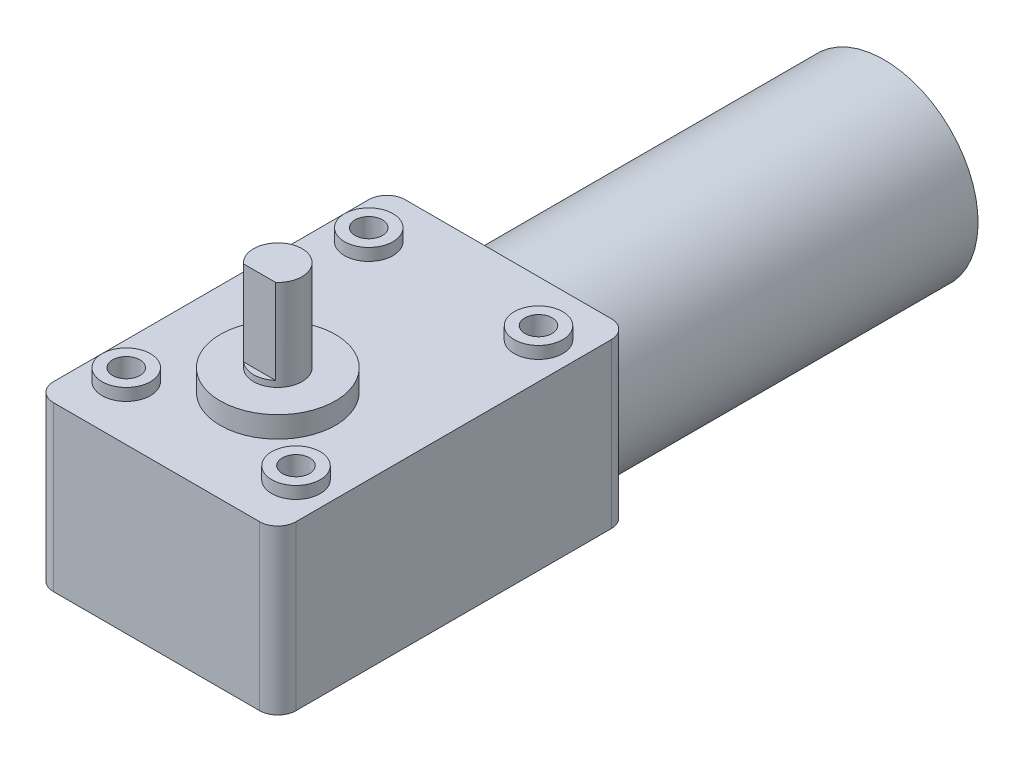
ISO-10303-21;
HEADER;
FILE_DESCRIPTION(('STEP AP214'),'2;1');
FILE_NAME('part.step','',(''),(''),'','','');
FILE_SCHEMA(('AUTOMOTIVE_DESIGN { 1 0 10303 214 1 1 1 1 }'));
ENDSEC;
DATA;
#1=APPLICATION_CONTEXT('core data for automotive mechanical design processes');
#2=APPLICATION_PROTOCOL_DEFINITION('international standard','automotive_design',2000,#1);
#3=PRODUCT_CONTEXT('',#1,'mechanical');
#4=PRODUCT('Part','Part','',(#3));
#5=PRODUCT_RELATED_PRODUCT_CATEGORY('part','',(#4));
#6=PRODUCT_DEFINITION_FORMATION('','',#4);
#7=PRODUCT_DEFINITION_CONTEXT('part definition',#1,'design');
#8=PRODUCT_DEFINITION('design','',#6,#7);
#9=PRODUCT_DEFINITION_SHAPE('','',#8);
#10=(LENGTH_UNIT() NAMED_UNIT(*) SI_UNIT(.MILLI.,.METRE.));
#11=(NAMED_UNIT(*) PLANE_ANGLE_UNIT() SI_UNIT($,.RADIAN.));
#12=(NAMED_UNIT(*) SI_UNIT($,.STERADIAN.) SOLID_ANGLE_UNIT());
#13=UNCERTAINTY_MEASURE_WITH_UNIT(LENGTH_MEASURE(1.E-05),#10,'distance_accuracy_value','');
#14=(GEOMETRIC_REPRESENTATION_CONTEXT(3) GLOBAL_UNCERTAINTY_ASSIGNED_CONTEXT((#13)) GLOBAL_UNIT_ASSIGNED_CONTEXT((#10,
#11,#12)) REPRESENTATION_CONTEXT('',''));
#15=CARTESIAN_POINT('',(0.,0.,0.));
#16=DIRECTION('',(0.,0.,1.));
#17=DIRECTION('',(1.,0.,0.));
#18=AXIS2_PLACEMENT_3D('',#15,#16,#17);
#19=CARTESIAN_POINT('',(-37.,27.,-55.));
#20=DIRECTION('',(0.,-1.,0.));
#21=DIRECTION('',(0.,0.,-1.));
#22=AXIS2_PLACEMENT_3D('',#19,#20,#21);
#23=CYLINDRICAL_SURFACE('',#22,3.);
#24=CARTESIAN_POINT('',(-37.,0.,-55.));
#25=DIRECTION('',(0.,1.,0.));
#26=DIRECTION('',(0.,0.,1.));
#27=AXIS2_PLACEMENT_3D('',#24,#25,#26);
#28=CIRCLE('',#27,3.);
#29=CARTESIAN_POINT('',(-40.,0.,-55.));
#30=VERTEX_POINT('',#29);
#31=CARTESIAN_POINT('',(-37.,0.,-58.));
#32=VERTEX_POINT('',#31);
#33=EDGE_CURVE('E195',#30,#32,#28,.F.);
#34=ORIENTED_EDGE('',*,*,#33,.F.);
#35=DIRECTION('',(0.,-1.,0.));
#36=VECTOR('',#35,1.);
#37=CARTESIAN_POINT('',(-40.,27.,-55.));
#38=LINE('',#37,#36);
#39=CARTESIAN_POINT('',(-40.,27.,-55.));
#40=VERTEX_POINT('',#39);
#41=EDGE_CURVE('E336',#40,#30,#38,.T.);
#42=ORIENTED_EDGE('',*,*,#41,.F.);
#43=CARTESIAN_POINT('',(-37.,27.,-55.));
#44=DIRECTION('',(0.,1.,0.));
#45=DIRECTION('',(0.,0.,1.));
#46=AXIS2_PLACEMENT_3D('',#43,#44,#45);
#47=CIRCLE('',#46,3.);
#48=CARTESIAN_POINT('',(-37.,27.,-58.));
#49=VERTEX_POINT('',#48);
#50=EDGE_CURVE('E289',#40,#49,#47,.F.);
#51=ORIENTED_EDGE('',*,*,#50,.T.);
#52=DIRECTION('',(0.,-1.,0.));
#53=VECTOR('',#52,1.);
#54=CARTESIAN_POINT('',(-37.,27.,-58.));
#55=LINE('',#54,#53);
#56=EDGE_CURVE('E98',#49,#32,#55,.T.);
#57=ORIENTED_EDGE('',*,*,#56,.T.);
#58=EDGE_LOOP('',(#34,#42,#51,#57));
#59=FACE_BOUND('',#58,.T.);
#60=ADVANCED_FACE('F94',(#59),#23,.T.);
#61=CARTESIAN_POINT('',(-40.,27.,0.));
#62=DIRECTION('',(-1.,0.,0.));
#63=DIRECTION('',(0.,0.,1.));
#64=AXIS2_PLACEMENT_3D('',#61,#62,#63);
#65=PLANE('',#64);
#66=DIRECTION('',(0.,0.,-1.));
#67=VECTOR('',#66,1.);
#68=CARTESIAN_POINT('',(-40.,0.,0.));
#69=LINE('',#68,#67);
#70=CARTESIAN_POINT('',(-40.,0.,-3.00000000000002));
#71=VERTEX_POINT('',#70);
#72=EDGE_CURVE('E311',#71,#30,#69,.T.);
#73=ORIENTED_EDGE('',*,*,#72,.F.);
#74=DIRECTION('',(0.,-1.,0.));
#75=VECTOR('',#74,1.);
#76=CARTESIAN_POINT('',(-40.,27.,-3.00000000000002));
#77=LINE('',#76,#75);
#78=CARTESIAN_POINT('',(-40.,27.,-3.00000000000002));
#79=VERTEX_POINT('',#78);
#80=EDGE_CURVE('E335',#79,#71,#77,.T.);
#81=ORIENTED_EDGE('',*,*,#80,.F.);
#82=DIRECTION('',(0.,0.,-1.));
#83=VECTOR('',#82,1.);
#84=CARTESIAN_POINT('',(-40.,27.,0.));
#85=LINE('',#84,#83);
#86=EDGE_CURVE('E293',#79,#40,#85,.T.);
#87=ORIENTED_EDGE('',*,*,#86,.T.);
#88=ORIENTED_EDGE('',*,*,#41,.T.);
#89=EDGE_LOOP('',(#73,#81,#87,#88));
#90=FACE_BOUND('',#89,.T.);
#91=ADVANCED_FACE('F366',(#90),#65,.T.);
#92=CARTESIAN_POINT('',(-37.,27.,-3.));
#93=DIRECTION('',(0.,-1.,0.));
#94=DIRECTION('',(0.,0.,-1.));
#95=AXIS2_PLACEMENT_3D('',#92,#93,#94);
#96=CYLINDRICAL_SURFACE('',#95,3.);
#97=CARTESIAN_POINT('',(-37.,0.,-3.));
#98=DIRECTION('',(0.,1.,0.));
#99=DIRECTION('',(0.,0.,1.));
#100=AXIS2_PLACEMENT_3D('',#97,#98,#99);
#101=CIRCLE('',#100,3.);
#102=CARTESIAN_POINT('',(-37.,0.,0.));
#103=VERTEX_POINT('',#102);
#104=EDGE_CURVE('E313',#103,#71,#101,.F.);
#105=ORIENTED_EDGE('',*,*,#104,.F.);
#106=DIRECTION('',(0.,-1.,0.));
#107=VECTOR('',#106,1.);
#108=CARTESIAN_POINT('',(-37.,27.,0.));
#109=LINE('',#108,#107);
#110=CARTESIAN_POINT('',(-37.,27.,0.));
#111=VERTEX_POINT('',#110);
#112=EDGE_CURVE('E333',#111,#103,#109,.T.);
#113=ORIENTED_EDGE('',*,*,#112,.F.);
#114=CARTESIAN_POINT('',(-37.,27.,-3.));
#115=DIRECTION('',(0.,1.,0.));
#116=DIRECTION('',(0.,0.,1.));
#117=AXIS2_PLACEMENT_3D('',#114,#115,#116);
#118=CIRCLE('',#117,3.);
#119=EDGE_CURVE('E296',#111,#79,#118,.F.);
#120=ORIENTED_EDGE('',*,*,#119,.T.);
#121=ORIENTED_EDGE('',*,*,#80,.T.);
#122=EDGE_LOOP('',(#105,#113,#120,#121));
#123=FACE_BOUND('',#122,.T.);
#124=ADVANCED_FACE('F364',(#123),#96,.T.);
#125=CARTESIAN_POINT('',(0.,27.,0.));
#126=DIRECTION('',(0.,0.,1.));
#127=DIRECTION('',(1.,0.,0.));
#128=AXIS2_PLACEMENT_3D('',#125,#126,#127);
#129=PLANE('',#128);
#130=DIRECTION('',(-1.,0.,0.));
#131=VECTOR('',#130,1.);
#132=CARTESIAN_POINT('',(0.,0.,0.));
#133=LINE('',#132,#131);
#134=CARTESIAN_POINT('',(-3.00000000000002,0.,0.));
#135=VERTEX_POINT('',#134);
#136=EDGE_CURVE('E316',#135,#103,#133,.T.);
#137=ORIENTED_EDGE('',*,*,#136,.F.);
#138=DIRECTION('',(0.,-1.,0.));
#139=VECTOR('',#138,1.);
#140=CARTESIAN_POINT('',(-3.00000000000002,27.,0.));
#141=LINE('',#140,#139);
#142=CARTESIAN_POINT('',(-3.00000000000002,27.,0.));
#143=VERTEX_POINT('',#142);
#144=EDGE_CURVE('E331',#143,#135,#141,.T.);
#145=ORIENTED_EDGE('',*,*,#144,.F.);
#146=DIRECTION('',(-1.,0.,0.));
#147=VECTOR('',#146,1.);
#148=CARTESIAN_POINT('',(0.,27.,0.));
#149=LINE('',#148,#147);
#150=EDGE_CURVE('E299',#143,#111,#149,.T.);
#151=ORIENTED_EDGE('',*,*,#150,.T.);
#152=ORIENTED_EDGE('',*,*,#112,.T.);
#153=EDGE_LOOP('',(#137,#145,#151,#152));
#154=FACE_BOUND('',#153,.T.);
#155=ADVANCED_FACE('F361',(#154),#129,.T.);
#156=CARTESIAN_POINT('',(-3.,27.,-3.));
#157=DIRECTION('',(0.,-1.,0.));
#158=DIRECTION('',(0.,0.,-1.));
#159=AXIS2_PLACEMENT_3D('',#156,#157,#158);
#160=CYLINDRICAL_SURFACE('',#159,3.);
#161=CARTESIAN_POINT('',(-3.,0.,-3.));
#162=DIRECTION('',(0.,1.,0.));
#163=DIRECTION('',(0.,0.,1.));
#164=AXIS2_PLACEMENT_3D('',#161,#162,#163);
#165=CIRCLE('',#164,3.);
#166=CARTESIAN_POINT('',(0.,0.,-3.00000000000002));
#167=VERTEX_POINT('',#166);
#168=EDGE_CURVE('E319',#167,#135,#165,.F.);
#169=ORIENTED_EDGE('',*,*,#168,.F.);
#170=DIRECTION('',(0.,-1.,0.));
#171=VECTOR('',#170,1.);
#172=CARTESIAN_POINT('',(0.,27.,-3.00000000000002));
#173=LINE('',#172,#171);
#174=CARTESIAN_POINT('',(0.,27.,-3.00000000000002));
#175=VERTEX_POINT('',#174);
#176=EDGE_CURVE('E329',#175,#167,#173,.T.);
#177=ORIENTED_EDGE('',*,*,#176,.F.);
#178=CARTESIAN_POINT('',(-3.,27.,-3.));
#179=DIRECTION('',(0.,1.,0.));
#180=DIRECTION('',(0.,0.,1.));
#181=AXIS2_PLACEMENT_3D('',#178,#179,#180);
#182=CIRCLE('',#181,3.);
#183=EDGE_CURVE('E302',#175,#143,#182,.F.);
#184=ORIENTED_EDGE('',*,*,#183,.T.);
#185=ORIENTED_EDGE('',*,*,#144,.T.);
#186=EDGE_LOOP('',(#169,#177,#184,#185));
#187=FACE_BOUND('',#186,.T.);
#188=ADVANCED_FACE('F357',(#187),#160,.T.);
#189=CARTESIAN_POINT('',(0.,27.,0.));
#190=DIRECTION('',(-1.,0.,0.));
#191=DIRECTION('',(0.,0.,1.));
#192=AXIS2_PLACEMENT_3D('',#189,#190,#191);
#193=PLANE('',#192);
#194=DIRECTION('',(0.,0.,-1.));
#195=VECTOR('',#194,1.);
#196=CARTESIAN_POINT('',(0.,0.,0.));
#197=LINE('',#196,#195);
#198=CARTESIAN_POINT('',(0.,0.,-55.));
#199=VERTEX_POINT('',#198);
#200=EDGE_CURVE('E322',#167,#199,#197,.T.);
#201=ORIENTED_EDGE('',*,*,#200,.T.);
#202=DIRECTION('',(0.,-1.,0.));
#203=VECTOR('',#202,1.);
#204=CARTESIAN_POINT('',(0.,27.,-55.));
#205=LINE('',#204,#203);
#206=CARTESIAN_POINT('',(0.,27.,-55.));
#207=VERTEX_POINT('',#206);
#208=EDGE_CURVE('E326',#207,#199,#205,.T.);
#209=ORIENTED_EDGE('',*,*,#208,.F.);
#210=DIRECTION('',(0.,0.,-1.));
#211=VECTOR('',#210,1.);
#212=CARTESIAN_POINT('',(0.,27.,0.));
#213=LINE('',#212,#211);
#214=EDGE_CURVE('E305',#175,#207,#213,.T.);
#215=ORIENTED_EDGE('',*,*,#214,.F.);
#216=ORIENTED_EDGE('',*,*,#176,.T.);
#217=EDGE_LOOP('',(#201,#209,#215,#216));
#218=FACE_BOUND('',#217,.T.);
#219=ADVANCED_FACE('F379',(#218),#193,.F.);
#220=CARTESIAN_POINT('',(-3.,27.,-55.));
#221=DIRECTION('',(0.,-1.,0.));
#222=DIRECTION('',(0.,0.,-1.));
#223=AXIS2_PLACEMENT_3D('',#220,#221,#222);
#224=CYLINDRICAL_SURFACE('',#223,3.);
#225=CARTESIAN_POINT('',(-3.,0.,-55.));
#226=DIRECTION('',(0.,1.,0.));
#227=DIRECTION('',(0.,0.,1.));
#228=AXIS2_PLACEMENT_3D('',#225,#226,#227);
#229=CIRCLE('',#228,3.);
#230=CARTESIAN_POINT('',(-3.00000000000002,0.,-58.));
#231=VERTEX_POINT('',#230);
#232=EDGE_CURVE('E290',#199,#231,#229,.T.);
#233=ORIENTED_EDGE('',*,*,#232,.T.);
#234=DIRECTION('',(0.,-1.,0.));
#235=VECTOR('',#234,1.);
#236=CARTESIAN_POINT('',(-3.00000000000002,27.,-58.));
#237=LINE('',#236,#235);
#238=CARTESIAN_POINT('',(-3.00000000000002,27.,-58.));
#239=VERTEX_POINT('',#238);
#240=EDGE_CURVE('E308',#239,#231,#237,.T.);
#241=ORIENTED_EDGE('',*,*,#240,.F.);
#242=CARTESIAN_POINT('',(-3.,27.,-55.));
#243=DIRECTION('',(0.,1.,0.));
#244=DIRECTION('',(0.,0.,1.));
#245=AXIS2_PLACEMENT_3D('',#242,#243,#244);
#246=CIRCLE('',#245,3.);
#247=EDGE_CURVE('E307',#207,#239,#246,.T.);
#248=ORIENTED_EDGE('',*,*,#247,.F.);
#249=ORIENTED_EDGE('',*,*,#208,.T.);
#250=EDGE_LOOP('',(#233,#241,#248,#249));
#251=FACE_BOUND('',#250,.T.);
#252=ADVANCED_FACE('F351',(#251),#224,.T.);
#253=CARTESIAN_POINT('',(0.,27.,-58.));
#254=DIRECTION('',(0.,0.,1.));
#255=DIRECTION('',(1.,0.,0.));
#256=AXIS2_PLACEMENT_3D('',#253,#254,#255);
#257=PLANE('',#256);
#258=CARTESIAN_POINT('',(-20.,9.,-58.));
#259=DIRECTION('',(0.,0.,-1.));
#260=DIRECTION('',(-1.,0.,0.));
#261=AXIS2_PLACEMENT_3D('',#258,#259,#260);
#262=CIRCLE('',#261,15.5);
#263=CARTESIAN_POINT('',(-32.619429464124,0.,-58.));
#264=VERTEX_POINT('',#263);
#265=CARTESIAN_POINT('',(-7.38057053587603,0.,-58.));
#266=VERTEX_POINT('',#265);
#267=EDGE_CURVE('E203',#264,#266,#262,.T.);
#268=ORIENTED_EDGE('',*,*,#267,.F.);
#269=DIRECTION('',(-1.,0.,0.));
#270=VECTOR('',#269,1.);
#271=CARTESIAN_POINT('',(0.,0.,-58.));
#272=LINE('',#271,#270);
#273=EDGE_CURVE('E190',#264,#32,#272,.T.);
#274=ORIENTED_EDGE('',*,*,#273,.T.);
#275=ORIENTED_EDGE('',*,*,#56,.F.);
#276=DIRECTION('',(-1.,0.,0.));
#277=VECTOR('',#276,1.);
#278=CARTESIAN_POINT('',(0.,27.,-58.));
#279=LINE('',#278,#277);
#280=EDGE_CURVE('E287',#239,#49,#279,.T.);
#281=ORIENTED_EDGE('',*,*,#280,.F.);
#282=ORIENTED_EDGE('',*,*,#240,.T.);
#283=EDGE_CURVE('E201',#231,#266,#272,.T.);
#284=ORIENTED_EDGE('',*,*,#283,.T.);
#285=EDGE_LOOP('',(#268,#274,#275,#281,#282,#284));
#286=FACE_BOUND('',#285,.T.);
#287=ADVANCED_FACE('F96',(#286),#257,.F.);
#288=CARTESIAN_POINT('',(0.,0.,0.));
#289=DIRECTION('',(0.,1.,0.));
#290=DIRECTION('',(0.,0.,1.));
#291=AXIS2_PLACEMENT_3D('',#288,#289,#290);
#292=PLANE('',#291);
#293=ORIENTED_EDGE('',*,*,#283,.F.);
#294=ORIENTED_EDGE('',*,*,#232,.F.);
#295=ORIENTED_EDGE('',*,*,#200,.F.);
#296=ORIENTED_EDGE('',*,*,#168,.T.);
#297=ORIENTED_EDGE('',*,*,#136,.T.);
#298=ORIENTED_EDGE('',*,*,#104,.T.);
#299=ORIENTED_EDGE('',*,*,#72,.T.);
#300=ORIENTED_EDGE('',*,*,#33,.T.);
#301=ORIENTED_EDGE('',*,*,#273,.F.);
#302=EDGE_CURVE('E111',#266,#264,#272,.T.);
#303=ORIENTED_EDGE('',*,*,#302,.F.);
#304=EDGE_LOOP('',(#293,#294,#295,#296,#297,#298,#299,#300,#301,#303));
#305=FACE_BOUND('',#304,.T.);
#306=ADVANCED_FACE('F192',(#305),#292,.F.);
#307=CARTESIAN_POINT('',(0.,27.,0.));
#308=DIRECTION('',(0.,1.,0.));
#309=DIRECTION('',(0.,0.,1.));
#310=AXIS2_PLACEMENT_3D('',#307,#308,#309);
#311=PLANE('',#310);
#312=CARTESIAN_POINT('',(-20.,27.,-20.));
#313=DIRECTION('',(0.,1.,0.));
#314=DIRECTION('',(0.,0.,1.));
#315=AXIS2_PLACEMENT_3D('',#312,#313,#314);
#316=CIRCLE('',#315,9.5);
#317=CARTESIAN_POINT('',(-20.,27.,-10.5));
#318=VERTEX_POINT('',#317);
#319=EDGE_CURVE('E256',#318,#318,#316,.T.);
#320=ORIENTED_EDGE('',*,*,#319,.F.);
#321=EDGE_LOOP('',(#320));
#322=FACE_BOUND('',#321,.T.);
#323=CARTESIAN_POINT('',(-34.,27.,-49.));
#324=DIRECTION('',(0.,1.,0.));
#325=DIRECTION('',(0.,0.,1.));
#326=AXIS2_PLACEMENT_3D('',#323,#324,#325);
#327=CIRCLE('',#326,4.);
#328=CARTESIAN_POINT('',(-34.,27.,-45.));
#329=VERTEX_POINT('',#328);
#330=EDGE_CURVE('E262',#329,#329,#327,.T.);
#331=ORIENTED_EDGE('',*,*,#330,.F.);
#332=EDGE_LOOP('',(#331));
#333=FACE_BOUND('',#332,.T.);
#334=CARTESIAN_POINT('',(-6.,27.,-49.0000000000003));
#335=DIRECTION('',(0.,1.,0.));
#336=DIRECTION('',(0.,0.,1.));
#337=AXIS2_PLACEMENT_3D('',#334,#335,#336);
#338=CIRCLE('',#337,4.);
#339=CARTESIAN_POINT('',(-6.,27.,-45.0000000000003));
#340=VERTEX_POINT('',#339);
#341=EDGE_CURVE('E268',#340,#340,#338,.T.);
#342=ORIENTED_EDGE('',*,*,#341,.F.);
#343=EDGE_LOOP('',(#342));
#344=FACE_BOUND('',#343,.T.);
#345=CARTESIAN_POINT('',(-6.,27.,-9.00000000000029));
#346=DIRECTION('',(0.,1.,0.));
#347=DIRECTION('',(0.,0.,1.));
#348=AXIS2_PLACEMENT_3D('',#345,#346,#347);
#349=CIRCLE('',#348,4.);
#350=CARTESIAN_POINT('',(-6.,27.,-5.00000000000029));
#351=VERTEX_POINT('',#350);
#352=EDGE_CURVE('E274',#351,#351,#349,.T.);
#353=ORIENTED_EDGE('',*,*,#352,.F.);
#354=EDGE_LOOP('',(#353));
#355=FACE_BOUND('',#354,.T.);
#356=CARTESIAN_POINT('',(-34.,27.,-9.));
#357=DIRECTION('',(0.,1.,0.));
#358=DIRECTION('',(0.,0.,1.));
#359=AXIS2_PLACEMENT_3D('',#356,#357,#358);
#360=CIRCLE('',#359,4.);
#361=CARTESIAN_POINT('',(-34.,27.,-5.));
#362=VERTEX_POINT('',#361);
#363=EDGE_CURVE('E280',#362,#362,#360,.T.);
#364=ORIENTED_EDGE('',*,*,#363,.F.);
#365=EDGE_LOOP('',(#364));
#366=FACE_BOUND('',#365,.T.);
#367=ORIENTED_EDGE('',*,*,#280,.T.);
#368=ORIENTED_EDGE('',*,*,#50,.F.);
#369=ORIENTED_EDGE('',*,*,#86,.F.);
#370=ORIENTED_EDGE('',*,*,#119,.F.);
#371=ORIENTED_EDGE('',*,*,#150,.F.);
#372=ORIENTED_EDGE('',*,*,#183,.F.);
#373=ORIENTED_EDGE('',*,*,#214,.T.);
#374=ORIENTED_EDGE('',*,*,#247,.T.);
#375=EDGE_LOOP('',(#367,#368,#369,#370,#371,#372,#373,#374));
#376=FACE_BOUND('',#375,.T.);
#377=ADVANCED_FACE('F344',(#322,#333,#344,#355,#366,#376),#311,.T.);
#378=CARTESIAN_POINT('',(-34.,29.,-9.));
#379=DIRECTION('',(0.,-1.,0.));
#380=DIRECTION('',(0.,0.,-1.));
#381=AXIS2_PLACEMENT_3D('',#378,#379,#380);
#382=CYLINDRICAL_SURFACE('',#381,4.);
#383=CARTESIAN_POINT('',(-34.,29.,-9.));
#384=DIRECTION('',(0.,1.,0.));
#385=DIRECTION('',(0.,0.,1.));
#386=AXIS2_PLACEMENT_3D('',#383,#384,#385);
#387=CIRCLE('',#386,4.);
#388=CARTESIAN_POINT('',(-34.,29.,-5.));
#389=VERTEX_POINT('',#388);
#390=EDGE_CURVE('E199',#389,#389,#387,.T.);
#391=ORIENTED_EDGE('',*,*,#390,.F.);
#392=EDGE_LOOP('',(#391));
#393=FACE_BOUND('',#392,.T.);
#394=ORIENTED_EDGE('',*,*,#363,.T.);
#395=EDGE_LOOP('',(#394));
#396=FACE_BOUND('',#395,.T.);
#397=ADVANCED_FACE('F388',(#393,#396),#382,.T.);
#398=CARTESIAN_POINT('',(0.,29.,0.));
#399=DIRECTION('',(0.,1.,0.));
#400=DIRECTION('',(0.,0.,1.));
#401=AXIS2_PLACEMENT_3D('',#398,#399,#400);
#402=PLANE('',#401);
#403=CARTESIAN_POINT('',(-34.,29.,-9.));
#404=DIRECTION('',(0.,1.,0.));
#405=DIRECTION('',(0.,0.,1.));
#406=AXIS2_PLACEMENT_3D('',#403,#404,#405);
#407=CIRCLE('',#406,2.25);
#408=CARTESIAN_POINT('',(-34.,29.,-6.75000000000001));
#409=VERTEX_POINT('',#408);
#410=EDGE_CURVE('E216',#409,#409,#407,.T.);
#411=ORIENTED_EDGE('',*,*,#410,.F.);
#412=EDGE_LOOP('',(#411));
#413=FACE_BOUND('',#412,.T.);
#414=ORIENTED_EDGE('',*,*,#390,.T.);
#415=EDGE_LOOP('',(#414));
#416=FACE_BOUND('',#415,.T.);
#417=ADVANCED_FACE('F392',(#413,#416),#402,.T.);
#418=CARTESIAN_POINT('',(-6.,29.,-9.00000000000029));
#419=DIRECTION('',(0.,-1.,0.));
#420=DIRECTION('',(0.,0.,-1.));
#421=AXIS2_PLACEMENT_3D('',#418,#419,#420);
#422=CYLINDRICAL_SURFACE('',#421,4.);
#423=CARTESIAN_POINT('',(-6.,29.,-9.00000000000029));
#424=DIRECTION('',(0.,1.,0.));
#425=DIRECTION('',(0.,0.,1.));
#426=AXIS2_PLACEMENT_3D('',#423,#424,#425);
#427=CIRCLE('',#426,4.);
#428=CARTESIAN_POINT('',(-6.,29.,-5.00000000000029));
#429=VERTEX_POINT('',#428);
#430=EDGE_CURVE('E277',#429,#429,#427,.T.);
#431=ORIENTED_EDGE('',*,*,#430,.F.);
#432=EDGE_LOOP('',(#431));
#433=FACE_BOUND('',#432,.T.);
#434=ORIENTED_EDGE('',*,*,#352,.T.);
#435=EDGE_LOOP('',(#434));
#436=FACE_BOUND('',#435,.T.);
#437=ADVANCED_FACE('F396',(#433,#436),#422,.T.);
#438=CARTESIAN_POINT('',(0.,29.,0.));
#439=DIRECTION('',(0.,1.,0.));
#440=DIRECTION('',(0.,0.,1.));
#441=AXIS2_PLACEMENT_3D('',#438,#439,#440);
#442=PLANE('',#441);
#443=CARTESIAN_POINT('',(-6.,29.,-9.00000000000029));
#444=DIRECTION('',(0.,1.,0.));
#445=DIRECTION('',(0.,0.,1.));
#446=AXIS2_PLACEMENT_3D('',#443,#444,#445);
#447=CIRCLE('',#446,2.25);
#448=CARTESIAN_POINT('',(-6.,29.,-6.75000000000029));
#449=VERTEX_POINT('',#448);
#450=EDGE_CURVE('E236',#449,#449,#447,.T.);
#451=ORIENTED_EDGE('',*,*,#450,.F.);
#452=EDGE_LOOP('',(#451));
#453=FACE_BOUND('',#452,.T.);
#454=ORIENTED_EDGE('',*,*,#430,.T.);
#455=EDGE_LOOP('',(#454));
#456=FACE_BOUND('',#455,.T.);
#457=ADVANCED_FACE('F400',(#453,#456),#442,.T.);
#458=CARTESIAN_POINT('',(-6.,29.,-49.0000000000003));
#459=DIRECTION('',(0.,-1.,0.));
#460=DIRECTION('',(0.,0.,-1.));
#461=AXIS2_PLACEMENT_3D('',#458,#459,#460);
#462=CYLINDRICAL_SURFACE('',#461,4.);
#463=CARTESIAN_POINT('',(-6.,29.,-49.0000000000003));
#464=DIRECTION('',(0.,1.,0.));
#465=DIRECTION('',(0.,0.,1.));
#466=AXIS2_PLACEMENT_3D('',#463,#464,#465);
#467=CIRCLE('',#466,4.);
#468=CARTESIAN_POINT('',(-6.,29.,-45.0000000000003));
#469=VERTEX_POINT('',#468);
#470=EDGE_CURVE('E271',#469,#469,#467,.T.);
#471=ORIENTED_EDGE('',*,*,#470,.F.);
#472=EDGE_LOOP('',(#471));
#473=FACE_BOUND('',#472,.T.);
#474=ORIENTED_EDGE('',*,*,#341,.T.);
#475=EDGE_LOOP('',(#474));
#476=FACE_BOUND('',#475,.T.);
#477=ADVANCED_FACE('F404',(#473,#476),#462,.T.);
#478=CARTESIAN_POINT('',(0.,29.,0.));
#479=DIRECTION('',(0.,1.,0.));
#480=DIRECTION('',(0.,0.,1.));
#481=AXIS2_PLACEMENT_3D('',#478,#479,#480);
#482=PLANE('',#481);
#483=CARTESIAN_POINT('',(-6.,29.,-49.0000000000003));
#484=DIRECTION('',(0.,1.,0.));
#485=DIRECTION('',(0.,0.,1.));
#486=AXIS2_PLACEMENT_3D('',#483,#484,#485);
#487=CIRCLE('',#486,2.25);
#488=CARTESIAN_POINT('',(-6.,29.,-46.7500000000003));
#489=VERTEX_POINT('',#488);
#490=EDGE_CURVE('E230',#489,#489,#487,.T.);
#491=ORIENTED_EDGE('',*,*,#490,.F.);
#492=EDGE_LOOP('',(#491));
#493=FACE_BOUND('',#492,.T.);
#494=ORIENTED_EDGE('',*,*,#470,.T.);
#495=EDGE_LOOP('',(#494));
#496=FACE_BOUND('',#495,.T.);
#497=ADVANCED_FACE('F408',(#493,#496),#482,.T.);
#498=CARTESIAN_POINT('',(-34.,29.,-49.));
#499=DIRECTION('',(0.,-1.,0.));
#500=DIRECTION('',(0.,0.,-1.));
#501=AXIS2_PLACEMENT_3D('',#498,#499,#500);
#502=CYLINDRICAL_SURFACE('',#501,4.);
#503=CARTESIAN_POINT('',(-34.,29.,-49.));
#504=DIRECTION('',(0.,1.,0.));
#505=DIRECTION('',(0.,0.,1.));
#506=AXIS2_PLACEMENT_3D('',#503,#504,#505);
#507=CIRCLE('',#506,4.);
#508=CARTESIAN_POINT('',(-34.,29.,-45.));
#509=VERTEX_POINT('',#508);
#510=EDGE_CURVE('E265',#509,#509,#507,.T.);
#511=ORIENTED_EDGE('',*,*,#510,.F.);
#512=EDGE_LOOP('',(#511));
#513=FACE_BOUND('',#512,.T.);
#514=ORIENTED_EDGE('',*,*,#330,.T.);
#515=EDGE_LOOP('',(#514));
#516=FACE_BOUND('',#515,.T.);
#517=ADVANCED_FACE('F412',(#513,#516),#502,.T.);
#518=CARTESIAN_POINT('',(0.,29.,0.));
#519=DIRECTION('',(0.,1.,0.));
#520=DIRECTION('',(0.,0.,1.));
#521=AXIS2_PLACEMENT_3D('',#518,#519,#520);
#522=PLANE('',#521);
#523=CARTESIAN_POINT('',(-34.,29.,-49.));
#524=DIRECTION('',(0.,1.,0.));
#525=DIRECTION('',(0.,0.,1.));
#526=AXIS2_PLACEMENT_3D('',#523,#524,#525);
#527=CIRCLE('',#526,2.25);
#528=CARTESIAN_POINT('',(-34.,29.,-46.75));
#529=VERTEX_POINT('',#528);
#530=EDGE_CURVE('E224',#529,#529,#527,.T.);
#531=ORIENTED_EDGE('',*,*,#530,.F.);
#532=EDGE_LOOP('',(#531));
#533=FACE_BOUND('',#532,.T.);
#534=ORIENTED_EDGE('',*,*,#510,.T.);
#535=EDGE_LOOP('',(#534));
#536=FACE_BOUND('',#535,.T.);
#537=ADVANCED_FACE('F416',(#533,#536),#522,.T.);
#538=CARTESIAN_POINT('',(-20.,30.5,-20.));
#539=DIRECTION('',(0.,-1.,0.));
#540=DIRECTION('',(0.,0.,-1.));
#541=AXIS2_PLACEMENT_3D('',#538,#539,#540);
#542=CYLINDRICAL_SURFACE('',#541,9.5);
#543=CARTESIAN_POINT('',(-20.,30.5,-20.));
#544=DIRECTION('',(0.,1.,0.));
#545=DIRECTION('',(0.,0.,1.));
#546=AXIS2_PLACEMENT_3D('',#543,#544,#545);
#547=CIRCLE('',#546,9.5);
#548=CARTESIAN_POINT('',(-20.,30.5,-10.5));
#549=VERTEX_POINT('',#548);
#550=EDGE_CURVE('E259',#549,#549,#547,.T.);
#551=ORIENTED_EDGE('',*,*,#550,.F.);
#552=EDGE_LOOP('',(#551));
#553=FACE_BOUND('',#552,.T.);
#554=ORIENTED_EDGE('',*,*,#319,.T.);
#555=EDGE_LOOP('',(#554));
#556=FACE_BOUND('',#555,.T.);
#557=ADVANCED_FACE('F420',(#553,#556),#542,.T.);
#558=CARTESIAN_POINT('',(-20.,30.5,-20.));
#559=DIRECTION('',(0.,1.,0.));
#560=DIRECTION('',(0.,0.,1.));
#561=AXIS2_PLACEMENT_3D('',#558,#559,#560);
#562=PLANE('',#561);
#563=CARTESIAN_POINT('',(-20.,30.5,-20.));
#564=DIRECTION('',(0.,1.,0.));
#565=DIRECTION('',(0.,0.,1.));
#566=AXIS2_PLACEMENT_3D('',#563,#564,#565);
#567=CIRCLE('',#566,4.);
#568=CARTESIAN_POINT('',(-20.,30.5,-16.));
#569=VERTEX_POINT('',#568);
#570=EDGE_CURVE('E103',#569,#569,#567,.T.);
#571=ORIENTED_EDGE('',*,*,#570,.F.);
#572=EDGE_LOOP('',(#571));
#573=FACE_BOUND('',#572,.T.);
#574=ORIENTED_EDGE('',*,*,#550,.T.);
#575=EDGE_LOOP('',(#574));
#576=FACE_BOUND('',#575,.T.);
#577=ADVANCED_FACE('F424',(#573,#576),#562,.T.);
#578=CARTESIAN_POINT('',(-20.,31.5,-20.));
#579=DIRECTION('',(0.,-1.,0.));
#580=DIRECTION('',(0.,0.,-1.));
#581=AXIS2_PLACEMENT_3D('',#578,#579,#580);
#582=CYLINDRICAL_SURFACE('',#581,4.);
#583=CARTESIAN_POINT('',(-20.,31.5,-20.));
#584=DIRECTION('',(0.,1.,0.));
#585=DIRECTION('',(0.,0.,1.));
#586=AXIS2_PLACEMENT_3D('',#583,#584,#585);
#587=CIRCLE('',#586,4.);
#588=CARTESIAN_POINT('',(-22.6457513110646,31.5,-17.));
#589=VERTEX_POINT('',#588);
#590=CARTESIAN_POINT('',(-17.3542486889354,31.5,-17.));
#591=VERTEX_POINT('',#590);
#592=EDGE_CURVE('E254',#589,#591,#587,.T.);
#593=ORIENTED_EDGE('',*,*,#592,.F.);
#594=DIRECTION('',(0.,-1.,0.));
#595=VECTOR('',#594,1.);
#596=CARTESIAN_POINT('',(-22.6457513110646,45.5,-17.));
#597=LINE('',#596,#595);
#598=CARTESIAN_POINT('',(-22.6457513110646,45.5,-17.));
#599=VERTEX_POINT('',#598);
#600=EDGE_CURVE('E251',#599,#589,#597,.T.);
#601=ORIENTED_EDGE('',*,*,#600,.F.);
#602=CARTESIAN_POINT('',(-20.,45.5,-20.));
#603=DIRECTION('',(0.,1.,0.));
#604=DIRECTION('',(0.,0.,1.));
#605=AXIS2_PLACEMENT_3D('',#602,#603,#604);
#606=CIRCLE('',#605,4.);
#607=CARTESIAN_POINT('',(-17.3542486889354,45.5,-17.));
#608=VERTEX_POINT('',#607);
#609=EDGE_CURVE('E242',#608,#599,#606,.T.);
#610=ORIENTED_EDGE('',*,*,#609,.F.);
#611=DIRECTION('',(0.,-1.,0.));
#612=VECTOR('',#611,1.);
#613=CARTESIAN_POINT('',(-17.3542486889354,45.5,-17.));
#614=LINE('',#613,#612);
#615=EDGE_CURVE('E247',#608,#591,#614,.T.);
#616=ORIENTED_EDGE('',*,*,#615,.T.);
#617=EDGE_LOOP('',(#593,#601,#610,#616));
#618=FACE_BOUND('',#617,.T.);
#619=ORIENTED_EDGE('',*,*,#570,.T.);
#620=EDGE_LOOP('',(#619));
#621=FACE_BOUND('',#620,.T.);
#622=ADVANCED_FACE('F428',(#618,#621),#582,.T.);
#623=CARTESIAN_POINT('',(-20.,31.5,-20.));
#624=DIRECTION('',(0.,1.,0.));
#625=DIRECTION('',(0.,0.,1.));
#626=AXIS2_PLACEMENT_3D('',#623,#624,#625);
#627=PLANE('',#626);
#628=DIRECTION('',(1.,0.,0.));
#629=VECTOR('',#628,1.);
#630=CARTESIAN_POINT('',(-22.6457513110646,31.5,-17.));
#631=LINE('',#630,#629);
#632=EDGE_CURVE('E118',#589,#591,#631,.T.);
#633=ORIENTED_EDGE('',*,*,#632,.F.);
#634=ORIENTED_EDGE('',*,*,#592,.T.);
#635=EDGE_LOOP('',(#633,#634));
#636=FACE_BOUND('',#635,.T.);
#637=ADVANCED_FACE('F432',(#636),#627,.T.);
#638=CARTESIAN_POINT('',(-22.6457513110646,45.5,-17.));
#639=DIRECTION('',(0.,0.,-1.));
#640=DIRECTION('',(-1.,0.,0.));
#641=AXIS2_PLACEMENT_3D('',#638,#639,#640);
#642=PLANE('',#641);
#643=ORIENTED_EDGE('',*,*,#632,.T.);
#644=ORIENTED_EDGE('',*,*,#615,.F.);
#645=DIRECTION('',(1.,0.,0.));
#646=VECTOR('',#645,1.);
#647=CARTESIAN_POINT('',(-22.6457513110646,45.5,-17.));
#648=LINE('',#647,#646);
#649=EDGE_CURVE('E245',#599,#608,#648,.T.);
#650=ORIENTED_EDGE('',*,*,#649,.F.);
#651=ORIENTED_EDGE('',*,*,#600,.T.);
#652=EDGE_LOOP('',(#643,#644,#650,#651));
#653=FACE_BOUND('',#652,.T.);
#654=ADVANCED_FACE('F436',(#653),#642,.F.);
#655=CARTESIAN_POINT('',(-20.,45.5,-20.));
#656=DIRECTION('',(0.,1.,0.));
#657=DIRECTION('',(0.,0.,1.));
#658=AXIS2_PLACEMENT_3D('',#655,#656,#657);
#659=PLANE('',#658);
#660=ORIENTED_EDGE('',*,*,#609,.T.);
#661=ORIENTED_EDGE('',*,*,#649,.T.);
#662=EDGE_LOOP('',(#660,#661));
#663=FACE_BOUND('',#662,.T.);
#664=ADVANCED_FACE('F439',(#663),#659,.T.);
#665=CARTESIAN_POINT('',(-6.,20.,-9.00000000000029));
#666=DIRECTION('',(0.,1.,0.));
#667=DIRECTION('',(0.,0.,1.));
#668=AXIS2_PLACEMENT_3D('',#665,#666,#667);
#669=CONICAL_SURFACE('',#668,2.25,1.02974425867665);
#670=CARTESIAN_POINT('',(-6.,18.648063607188,-9.00000000000029));
#671=VERTEX_POINT('',#670);
#672=VERTEX_LOOP('',#671);
#673=FACE_BOUND('',#672,.T.);
#674=CARTESIAN_POINT('',(-6.,20.,-9.00000000000029));
#675=DIRECTION('',(0.,1.,0.));
#676=DIRECTION('',(0.,0.,1.));
#677=AXIS2_PLACEMENT_3D('',#674,#675,#676);
#678=CIRCLE('',#677,2.25);
#679=CARTESIAN_POINT('',(-6.,20.,-6.7500000000003));
#680=VERTEX_POINT('',#679);
#681=EDGE_CURVE('E239',#680,#680,#678,.T.);
#682=ORIENTED_EDGE('',*,*,#681,.T.);
#683=EDGE_LOOP('',(#682));
#684=FACE_BOUND('',#683,.T.);
#685=ADVANCED_FACE('F443',(#673,#684),#669,.F.);
#686=CARTESIAN_POINT('',(-6.,29.,-9.00000000000029));
#687=DIRECTION('',(0.,1.,0.));
#688=DIRECTION('',(0.,0.,1.));
#689=AXIS2_PLACEMENT_3D('',#686,#687,#688);
#690=CYLINDRICAL_SURFACE('',#689,2.25);
#691=ORIENTED_EDGE('',*,*,#681,.F.);
#692=EDGE_LOOP('',(#691));
#693=FACE_BOUND('',#692,.T.);
#694=ORIENTED_EDGE('',*,*,#450,.T.);
#695=EDGE_LOOP('',(#694));
#696=FACE_BOUND('',#695,.T.);
#697=ADVANCED_FACE('F447',(#693,#696),#690,.F.);
#698=CARTESIAN_POINT('',(-6.,20.,-49.0000000000003));
#699=DIRECTION('',(0.,1.,0.));
#700=DIRECTION('',(0.,0.,1.));
#701=AXIS2_PLACEMENT_3D('',#698,#699,#700);
#702=CONICAL_SURFACE('',#701,2.25,1.02974425867665);
#703=CARTESIAN_POINT('',(-6.,18.648063607188,-49.0000000000003));
#704=VERTEX_POINT('',#703);
#705=VERTEX_LOOP('',#704);
#706=FACE_BOUND('',#705,.T.);
#707=CARTESIAN_POINT('',(-6.,20.,-49.0000000000003));
#708=DIRECTION('',(0.,1.,0.));
#709=DIRECTION('',(0.,0.,1.));
#710=AXIS2_PLACEMENT_3D('',#707,#708,#709);
#711=CIRCLE('',#710,2.25);
#712=CARTESIAN_POINT('',(-6.,20.,-46.7500000000003));
#713=VERTEX_POINT('',#712);
#714=EDGE_CURVE('E233',#713,#713,#711,.T.);
#715=ORIENTED_EDGE('',*,*,#714,.T.);
#716=EDGE_LOOP('',(#715));
#717=FACE_BOUND('',#716,.T.);
#718=ADVANCED_FACE('F451',(#706,#717),#702,.F.);
#719=CARTESIAN_POINT('',(-6.,29.,-49.0000000000003));
#720=DIRECTION('',(0.,1.,0.));
#721=DIRECTION('',(0.,0.,1.));
#722=AXIS2_PLACEMENT_3D('',#719,#720,#721);
#723=CYLINDRICAL_SURFACE('',#722,2.25);
#724=ORIENTED_EDGE('',*,*,#714,.F.);
#725=EDGE_LOOP('',(#724));
#726=FACE_BOUND('',#725,.T.);
#727=ORIENTED_EDGE('',*,*,#490,.T.);
#728=EDGE_LOOP('',(#727));
#729=FACE_BOUND('',#728,.T.);
#730=ADVANCED_FACE('F455',(#726,#729),#723,.F.);
#731=CARTESIAN_POINT('',(-34.,20.,-49.));
#732=DIRECTION('',(0.,1.,0.));
#733=DIRECTION('',(0.,0.,1.));
#734=AXIS2_PLACEMENT_3D('',#731,#732,#733);
#735=CONICAL_SURFACE('',#734,2.25,1.02974425867665);
#736=CARTESIAN_POINT('',(-34.,18.648063607188,-49.));
#737=VERTEX_POINT('',#736);
#738=VERTEX_LOOP('',#737);
#739=FACE_BOUND('',#738,.T.);
#740=CARTESIAN_POINT('',(-34.,20.,-49.));
#741=DIRECTION('',(0.,1.,0.));
#742=DIRECTION('',(0.,0.,1.));
#743=AXIS2_PLACEMENT_3D('',#740,#741,#742);
#744=CIRCLE('',#743,2.25);
#745=CARTESIAN_POINT('',(-34.,20.,-46.75));
#746=VERTEX_POINT('',#745);
#747=EDGE_CURVE('E227',#746,#746,#744,.T.);
#748=ORIENTED_EDGE('',*,*,#747,.T.);
#749=EDGE_LOOP('',(#748));
#750=FACE_BOUND('',#749,.T.);
#751=ADVANCED_FACE('F459',(#739,#750),#735,.F.);
#752=CARTESIAN_POINT('',(-34.,29.,-49.));
#753=DIRECTION('',(0.,1.,0.));
#754=DIRECTION('',(0.,0.,1.));
#755=AXIS2_PLACEMENT_3D('',#752,#753,#754);
#756=CYLINDRICAL_SURFACE('',#755,2.25);
#757=ORIENTED_EDGE('',*,*,#747,.F.);
#758=EDGE_LOOP('',(#757));
#759=FACE_BOUND('',#758,.T.);
#760=ORIENTED_EDGE('',*,*,#530,.T.);
#761=EDGE_LOOP('',(#760));
#762=FACE_BOUND('',#761,.T.);
#763=ADVANCED_FACE('F463',(#759,#762),#756,.F.);
#764=CARTESIAN_POINT('',(-34.,20.,-9.));
#765=DIRECTION('',(0.,1.,0.));
#766=DIRECTION('',(0.,0.,1.));
#767=AXIS2_PLACEMENT_3D('',#764,#765,#766);
#768=CONICAL_SURFACE('',#767,2.25,1.02974425867665);
#769=CARTESIAN_POINT('',(-34.,18.648063607188,-9.));
#770=VERTEX_POINT('',#769);
#771=VERTEX_LOOP('',#770);
#772=FACE_BOUND('',#771,.T.);
#773=CARTESIAN_POINT('',(-34.,20.,-9.));
#774=DIRECTION('',(0.,1.,0.));
#775=DIRECTION('',(0.,0.,1.));
#776=AXIS2_PLACEMENT_3D('',#773,#774,#775);
#777=CIRCLE('',#776,2.25);
#778=CARTESIAN_POINT('',(-34.,20.,-6.75000000000001));
#779=VERTEX_POINT('',#778);
#780=EDGE_CURVE('E221',#779,#779,#777,.T.);
#781=ORIENTED_EDGE('',*,*,#780,.T.);
#782=EDGE_LOOP('',(#781));
#783=FACE_BOUND('',#782,.T.);
#784=ADVANCED_FACE('F467',(#772,#783),#768,.F.);
#785=CARTESIAN_POINT('',(-34.,29.,-9.));
#786=DIRECTION('',(0.,1.,0.));
#787=DIRECTION('',(0.,0.,1.));
#788=AXIS2_PLACEMENT_3D('',#785,#786,#787);
#789=CYLINDRICAL_SURFACE('',#788,2.25);
#790=ORIENTED_EDGE('',*,*,#780,.F.);
#791=EDGE_LOOP('',(#790));
#792=FACE_BOUND('',#791,.T.);
#793=ORIENTED_EDGE('',*,*,#410,.T.);
#794=EDGE_LOOP('',(#793));
#795=FACE_BOUND('',#794,.T.);
#796=ADVANCED_FACE('F471',(#792,#795),#789,.F.);
#797=CARTESIAN_POINT('',(-20.,9.,-58.));
#798=DIRECTION('',(0.,0.,-1.));
#799=DIRECTION('',(-1.,0.,0.));
#800=AXIS2_PLACEMENT_3D('',#797,#798,#799);
#801=PLANE('',#800);
#802=EDGE_CURVE('E208',#266,#264,#262,.T.);
#803=ORIENTED_EDGE('',*,*,#802,.F.);
#804=ORIENTED_EDGE('',*,*,#302,.T.);
#805=EDGE_LOOP('',(#803,#804));
#806=FACE_BOUND('',#805,.T.);
#807=ADVANCED_FACE('F212',(#806),#801,.F.);
#808=CARTESIAN_POINT('',(-20.,9.,-120.));
#809=DIRECTION('',(0.,0.,1.));
#810=DIRECTION('',(1.,0.,0.));
#811=AXIS2_PLACEMENT_3D('',#808,#809,#810);
#812=CYLINDRICAL_SURFACE('',#811,15.5);
#813=CARTESIAN_POINT('',(-20.,9.,-120.));
#814=DIRECTION('',(0.,0.,-1.));
#815=DIRECTION('',(-1.,0.,0.));
#816=AXIS2_PLACEMENT_3D('',#813,#814,#815);
#817=CIRCLE('',#816,15.5);
#818=CARTESIAN_POINT('',(-35.5,9.,-120.));
#819=VERTEX_POINT('',#818);
#820=EDGE_CURVE('E214',#819,#819,#817,.T.);
#821=ORIENTED_EDGE('',*,*,#820,.F.);
#822=EDGE_LOOP('',(#821));
#823=FACE_BOUND('',#822,.T.);
#824=ORIENTED_EDGE('',*,*,#802,.T.);
#825=ORIENTED_EDGE('',*,*,#267,.T.);
#826=EDGE_LOOP('',(#824,#825));
#827=FACE_BOUND('',#826,.T.);
#828=ADVANCED_FACE('F213',(#823,#827),#812,.T.);
#829=CARTESIAN_POINT('',(-20.,9.,-120.));
#830=DIRECTION('',(0.,0.,-1.));
#831=DIRECTION('',(-1.,0.,0.));
#832=AXIS2_PLACEMENT_3D('',#829,#830,#831);
#833=PLANE('',#832);
#834=CARTESIAN_POINT('',(-20.,9.,-120.));
#835=DIRECTION('',(0.,0.,-1.));
#836=DIRECTION('',(-1.,0.,0.));
#837=AXIS2_PLACEMENT_3D('',#834,#835,#836);
#838=CIRCLE('',#837,7.5);
#839=CARTESIAN_POINT('',(-27.5,9.,-120.));
#840=VERTEX_POINT('',#839);
#841=EDGE_CURVE('E12',#840,#840,#838,.T.);
#842=ORIENTED_EDGE('',*,*,#841,.F.);
#843=EDGE_LOOP('',(#842));
#844=FACE_BOUND('',#843,.T.);
#845=ORIENTED_EDGE('',*,*,#820,.T.);
#846=EDGE_LOOP('',(#845));
#847=FACE_BOUND('',#846,.T.);
#848=ADVANCED_FACE('F478',(#844,#847),#833,.T.);
#849=CARTESIAN_POINT('',(-20.,9.,-122.));
#850=DIRECTION('',(0.,0.,1.));
#851=DIRECTION('',(1.,0.,0.));
#852=AXIS2_PLACEMENT_3D('',#849,#850,#851);
#853=CYLINDRICAL_SURFACE('',#852,7.5);
#854=CARTESIAN_POINT('',(-20.,9.,-122.));
#855=DIRECTION('',(0.,0.,-1.));
#856=DIRECTION('',(-1.,0.,0.));
#857=AXIS2_PLACEMENT_3D('',#854,#855,#856);
#858=CIRCLE('',#857,7.5);
#859=CARTESIAN_POINT('',(-27.5,9.,-122.));
#860=VERTEX_POINT('',#859);
#861=EDGE_CURVE('E209',#860,#860,#858,.T.);
#862=ORIENTED_EDGE('',*,*,#861,.F.);
#863=EDGE_LOOP('',(#862));
#864=FACE_BOUND('',#863,.T.);
#865=ORIENTED_EDGE('',*,*,#841,.T.);
#866=EDGE_LOOP('',(#865));
#867=FACE_BOUND('',#866,.T.);
#868=ADVANCED_FACE('F484',(#864,#867),#853,.T.);
#869=CARTESIAN_POINT('',(-20.,9.,-122.));
#870=DIRECTION('',(0.,0.,-1.));
#871=DIRECTION('',(-1.,0.,0.));
#872=AXIS2_PLACEMENT_3D('',#869,#870,#871);
#873=PLANE('',#872);
#874=ORIENTED_EDGE('',*,*,#861,.T.);
#875=EDGE_LOOP('',(#874));
#876=FACE_BOUND('',#875,.T.);
#877=ADVANCED_FACE('F488',(#876),#873,.T.);
#878=CLOSED_SHELL('',(#60,#91,#124,#155,#188,#219,#252,#287,#306,#377,#397,#417,#437,#457,#477,
#497,#517,#537,#557,#577,#622,#637,#654,#664,#685,#697,#718,#730,#751,#763,#784,#796,#807,#828,
#848,#868,#877));
#879=MANIFOLD_SOLID_BREP('B2',#878);
#880=ADVANCED_BREP_SHAPE_REPRESENTATION('',(#18,#879),#14);
#881=SHAPE_DEFINITION_REPRESENTATION(#9,#880);
ENDSEC;
END-ISO-10303-21;
